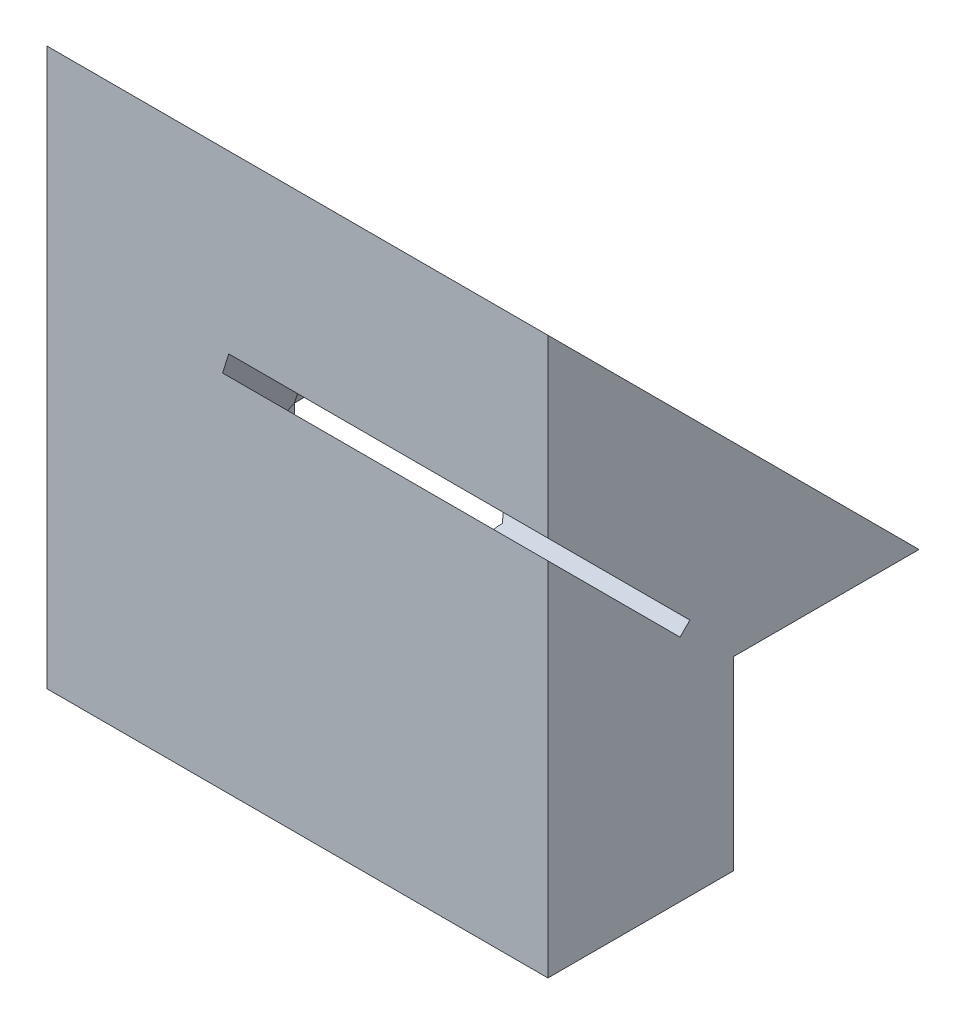
ISO-10303-21;
HEADER;
FILE_DESCRIPTION(('STEP AP214'),'2;1');
FILE_NAME('part.step','',(''),(''),'','','');
FILE_SCHEMA(('AUTOMOTIVE_DESIGN { 1 0 10303 214 1 1 1 1 }'));
ENDSEC;
DATA;
#1=APPLICATION_CONTEXT('core data for automotive mechanical design processes');
#2=APPLICATION_PROTOCOL_DEFINITION('international standard','automotive_design',2000,#1);
#3=PRODUCT_CONTEXT('',#1,'mechanical');
#4=PRODUCT('Part','Part','',(#3));
#5=PRODUCT_RELATED_PRODUCT_CATEGORY('part','',(#4));
#6=PRODUCT_DEFINITION_FORMATION('','',#4);
#7=PRODUCT_DEFINITION_CONTEXT('part definition',#1,'design');
#8=PRODUCT_DEFINITION('design','',#6,#7);
#9=PRODUCT_DEFINITION_SHAPE('','',#8);
#10=(LENGTH_UNIT() NAMED_UNIT(*) SI_UNIT(.MILLI.,.METRE.));
#11=(NAMED_UNIT(*) PLANE_ANGLE_UNIT() SI_UNIT($,.RADIAN.));
#12=(NAMED_UNIT(*) SI_UNIT($,.STERADIAN.) SOLID_ANGLE_UNIT());
#13=UNCERTAINTY_MEASURE_WITH_UNIT(LENGTH_MEASURE(1.E-05),#10,'distance_accuracy_value','');
#14=(GEOMETRIC_REPRESENTATION_CONTEXT(3) GLOBAL_UNCERTAINTY_ASSIGNED_CONTEXT((#13)) GLOBAL_UNIT_ASSIGNED_CONTEXT((#10,
#11,#12)) REPRESENTATION_CONTEXT('',''));
#15=CARTESIAN_POINT('',(0.,0.,0.));
#16=DIRECTION('',(0.,0.,1.));
#17=DIRECTION('',(1.,0.,0.));
#18=AXIS2_PLACEMENT_3D('',#15,#16,#17);
#19=CARTESIAN_POINT('',(0.,0.,0.));
#20=DIRECTION('',(0.,0.,1.));
#21=DIRECTION('',(1.,0.,0.));
#22=AXIS2_PLACEMENT_3D('',#19,#20,#21);
#23=PLANE('',#22);
#24=DIRECTION('',(1.,0.,0.));
#25=VECTOR('',#24,1.);
#26=CARTESIAN_POINT('',(-11.8038475772934,-20.,0.));
#27=LINE('',#26,#25);
#28=CARTESIAN_POINT('',(-9.04783659909774,-20.,0.));
#29=VERTEX_POINT('',#28);
#30=CARTESIAN_POINT('',(2.,-20.,0.));
#31=VERTEX_POINT('',#30);
#32=EDGE_CURVE('E198',#29,#31,#27,.T.);
#33=ORIENTED_EDGE('',*,*,#32,.F.);
#34=DIRECTION('',(0.,-1.,0.));
#35=VECTOR('',#34,1.);
#36=CARTESIAN_POINT('',(-9.04783659909774,0.,0.));
#37=LINE('',#36,#35);
#38=CARTESIAN_POINT('',(-9.04783659909778,-10.,0.));
#39=VERTEX_POINT('',#38);
#40=EDGE_CURVE('E188',#29,#39,#37,.F.);
#41=ORIENTED_EDGE('',*,*,#40,.T.);
#42=DIRECTION('',(-1.,0.,0.));
#43=VECTOR('',#42,1.);
#44=CARTESIAN_POINT('',(25.,-10.,0.));
#45=LINE('',#44,#43);
#46=CARTESIAN_POINT('',(2.,-10.,0.));
#47=VERTEX_POINT('',#46);
#48=EDGE_CURVE('E273',#47,#39,#45,.T.);
#49=ORIENTED_EDGE('',*,*,#48,.F.);
#50=DIRECTION('',(0.,-1.,0.));
#51=VECTOR('',#50,1.);
#52=CARTESIAN_POINT('',(2.,0.,0.));
#53=LINE('',#52,#51);
#54=EDGE_CURVE('E210',#47,#31,#53,.T.);
#55=ORIENTED_EDGE('',*,*,#54,.T.);
#56=EDGE_LOOP('',(#33,#41,#49,#55));
#57=FACE_BOUND('',#56,.T.);
#58=ADVANCED_FACE('F35',(#57),#23,.F.);
#59=DIRECTION('',(-1.,0.,0.));
#60=VECTOR('',#59,1.);
#61=CARTESIAN_POINT('',(-21.6643139440744,-10.,0.));
#62=LINE('',#61,#60);
#63=CARTESIAN_POINT('',(-21.6643139440744,-9.99999999999999,0.));
#64=VERTEX_POINT('',#63);
#65=CARTESIAN_POINT('',(-25.,-10.,0.));
#66=VERTEX_POINT('',#65);
#67=EDGE_CURVE('E275',#64,#66,#62,.T.);
#68=ORIENTED_EDGE('',*,*,#67,.F.);
#69=DIRECTION('',(0.,1.,0.));
#70=VECTOR('',#69,1.);
#71=CARTESIAN_POINT('',(-21.6643139440744,-20.,0.));
#72=LINE('',#71,#70);
#73=CARTESIAN_POINT('',(-21.6643139440744,-20.,0.));
#74=VERTEX_POINT('',#73);
#75=EDGE_CURVE('E246',#74,#64,#72,.T.);
#76=ORIENTED_EDGE('',*,*,#75,.F.);
#77=DIRECTION('',(1.,0.,0.));
#78=VECTOR('',#77,1.);
#79=CARTESIAN_POINT('',(-25.,-20.,0.));
#80=LINE('',#79,#78);
#81=CARTESIAN_POINT('',(-25.,-20.,0.));
#82=VERTEX_POINT('',#81);
#83=EDGE_CURVE('E259',#82,#74,#80,.T.);
#84=ORIENTED_EDGE('',*,*,#83,.F.);
#85=DIRECTION('',(0.,-1.,0.));
#86=VECTOR('',#85,1.);
#87=CARTESIAN_POINT('',(-25.,10.,0.));
#88=LINE('',#87,#86);
#89=EDGE_CURVE('E165',#66,#82,#88,.T.);
#90=ORIENTED_EDGE('',*,*,#89,.F.);
#91=EDGE_LOOP('',(#68,#76,#84,#90));
#92=FACE_BOUND('',#91,.T.);
#93=ADVANCED_FACE('F328',(#92),#23,.F.);
#94=CARTESIAN_POINT('',(0.,0.,10.));
#95=DIRECTION('',(0.,0.,1.));
#96=DIRECTION('',(1.,0.,0.));
#97=AXIS2_PLACEMENT_3D('',#94,#95,#96);
#98=PLANE('',#97);
#99=DIRECTION('',(0.,-1.,0.));
#100=VECTOR('',#99,1.);
#101=CARTESIAN_POINT('',(2.,0.,10.));
#102=LINE('',#101,#100);
#103=CARTESIAN_POINT('',(2.,10.,10.));
#104=VERTEX_POINT('',#103);
#105=CARTESIAN_POINT('',(2.,0.530330085889943,10.));
#106=VERTEX_POINT('',#105);
#107=EDGE_CURVE('E164',#104,#106,#102,.T.);
#108=ORIENTED_EDGE('',*,*,#107,.F.);
#109=DIRECTION('',(-1.,0.,0.));
#110=VECTOR('',#109,1.);
#111=CARTESIAN_POINT('',(-25.,10.,10.));
#112=LINE('',#111,#110);
#113=CARTESIAN_POINT('',(-25.,10.,10.));
#114=VERTEX_POINT('',#113);
#115=EDGE_CURVE('E145',#104,#114,#112,.T.);
#116=ORIENTED_EDGE('',*,*,#115,.T.);
#117=DIRECTION('',(0.,-1.,0.));
#118=VECTOR('',#117,1.);
#119=CARTESIAN_POINT('',(-25.,10.,10.));
#120=LINE('',#119,#118);
#121=CARTESIAN_POINT('',(-25.,-20.,10.));
#122=VERTEX_POINT('',#121);
#123=EDGE_CURVE('E161',#114,#122,#120,.T.);
#124=ORIENTED_EDGE('',*,*,#123,.T.);
#125=DIRECTION('',(-1.,0.,0.));
#126=VECTOR('',#125,1.);
#127=CARTESIAN_POINT('',(25.,-20.,10.));
#128=LINE('',#127,#126);
#129=CARTESIAN_POINT('',(2.,-20.,10.));
#130=VERTEX_POINT('',#129);
#131=EDGE_CURVE('E211',#130,#122,#128,.T.);
#132=ORIENTED_EDGE('',*,*,#131,.F.);
#133=CARTESIAN_POINT('',(2.,-0.530330085889881,10.));
#134=VERTEX_POINT('',#133);
#135=EDGE_CURVE('E280',#134,#130,#102,.T.);
#136=ORIENTED_EDGE('',*,*,#135,.F.);
#137=DIRECTION('',(1.,0.,0.));
#138=VECTOR('',#137,1.);
#139=CARTESIAN_POINT('',(0.,-0.530330085889881,10.));
#140=LINE('',#139,#138);
#141=CARTESIAN_POINT('',(-15.5347902498564,-0.530330085889881,10.));
#142=VERTEX_POINT('',#141);
#143=EDGE_CURVE('E181',#142,#134,#140,.T.);
#144=ORIENTED_EDGE('',*,*,#143,.F.);
#145=DIRECTION('',(-0.300294039609494,-0.953846680434026,0.));
#146=VECTOR('',#145,1.);
#147=CARTESIAN_POINT('',(-13.9820122594664,4.40187613941699,10.));
#148=LINE('',#147,#146);
#149=CARTESIAN_POINT('',(-15.200868735875,0.530330085889944,10.));
#150=VERTEX_POINT('',#149);
#151=EDGE_CURVE('E235',#150,#142,#148,.T.);
#152=ORIENTED_EDGE('',*,*,#151,.F.);
#153=DIRECTION('',(1.,0.,0.));
#154=VECTOR('',#153,1.);
#155=CARTESIAN_POINT('',(0.,0.530330085889941,10.));
#156=LINE('',#155,#154);
#157=EDGE_CURVE('E242',#150,#106,#156,.T.);
#158=ORIENTED_EDGE('',*,*,#157,.T.);
#159=EDGE_LOOP('',(#108,#116,#124,#132,#136,#144,#152,#158));
#160=FACE_BOUND('',#159,.T.);
#161=ADVANCED_FACE('F159',(#160),#98,.T.);
#162=CARTESIAN_POINT('',(-25.,10.,10.));
#163=DIRECTION('',(1.,0.,0.));
#164=DIRECTION('',(0.,1.,0.));
#165=AXIS2_PLACEMENT_3D('',#162,#163,#164);
#166=PLANE('',#165);
#167=ORIENTED_EDGE('',*,*,#123,.F.);
#168=DIRECTION('',(0.,-0.707106781186548,-0.707106781186548));
#169=VECTOR('',#168,1.);
#170=CARTESIAN_POINT('',(-25.,10.,10.));
#171=LINE('',#170,#169);
#172=CARTESIAN_POINT('',(-25.,-10.,-10.));
#173=VERTEX_POINT('',#172);
#174=EDGE_CURVE('E141',#114,#173,#171,.T.);
#175=ORIENTED_EDGE('',*,*,#174,.T.);
#176=DIRECTION('',(0.,0.,1.));
#177=VECTOR('',#176,1.);
#178=CARTESIAN_POINT('',(-25.,-10.,-10.));
#179=LINE('',#178,#177);
#180=EDGE_CURVE('E270',#173,#66,#179,.T.);
#181=ORIENTED_EDGE('',*,*,#180,.T.);
#182=ORIENTED_EDGE('',*,*,#89,.T.);
#183=DIRECTION('',(0.,0.,-1.));
#184=VECTOR('',#183,1.);
#185=CARTESIAN_POINT('',(-25.,-20.,10.));
#186=LINE('',#185,#184);
#187=EDGE_CURVE('E169',#122,#82,#186,.T.);
#188=ORIENTED_EDGE('',*,*,#187,.F.);
#189=EDGE_LOOP('',(#167,#175,#181,#182,#188));
#190=FACE_BOUND('',#189,.T.);
#191=ADVANCED_FACE('F167',(#190),#166,.F.);
#192=CARTESIAN_POINT('',(0.,-5.26516504294494,5.26516504294496));
#193=DIRECTION('',(0.,-0.707106781186546,0.707106781186549));
#194=DIRECTION('',(0.,-0.707106781186549,-0.707106781186546));
#195=AXIS2_PLACEMENT_3D('',#192,#193,#194);
#196=PLANE('',#195);
#197=ORIENTED_EDGE('',*,*,#143,.T.);
#198=DIRECTION('',(0.,-0.707106781186549,-0.707106781186546));
#199=VECTOR('',#198,1.);
#200=CARTESIAN_POINT('',(2.,-5.26516504294494,5.26516504294496));
#201=LINE('',#200,#199);
#202=CARTESIAN_POINT('',(2.,-7.64976811196693,2.88056197392298));
#203=VERTEX_POINT('',#202);
#204=EDGE_CURVE('E226',#134,#203,#201,.T.);
#205=ORIENTED_EDGE('',*,*,#204,.T.);
#206=DIRECTION('',(0.965925826289068,0.18301270189222,0.18301270189222));
#207=VECTOR('',#206,1.);
#208=CARTESIAN_POINT('',(-23.,-12.3864853865046,-1.85615530061468));
#209=LINE('',#208,#207);
#210=CARTESIAN_POINT('',(-10.4043285244551,-10.,0.530330085889914));
#211=VERTEX_POINT('',#210);
#212=EDGE_CURVE('E220',#211,#203,#209,.T.);
#213=ORIENTED_EDGE('',*,*,#212,.F.);
#214=DIRECTION('',(1.,0.,0.));
#215=VECTOR('',#214,1.);
#216=CARTESIAN_POINT('',(-25.,-10.,0.530330085889914));
#217=LINE('',#216,#215);
#218=CARTESIAN_POINT('',(-21.4973531870837,-10.,0.530330085889913));
#219=VERTEX_POINT('',#218);
#220=EDGE_CURVE('E177',#219,#211,#217,.T.);
#221=ORIENTED_EDGE('',*,*,#220,.F.);
#222=DIRECTION('',(-0.406736643075797,-0.645974188021253,-0.645974188021251));
#223=VECTOR('',#222,1.);
#224=CARTESIAN_POINT('',(-23.,-12.3864853865046,-1.85615530061468));
#225=LINE('',#224,#223);
#226=EDGE_CURVE('E228',#142,#219,#225,.T.);
#227=ORIENTED_EDGE('',*,*,#226,.F.);
#228=EDGE_LOOP('',(#197,#205,#213,#221,#227));
#229=FACE_BOUND('',#228,.T.);
#230=ADVANCED_FACE('F224',(#229),#196,.F.);
#231=CARTESIAN_POINT('',(-23.,-11.8561553006147,-2.38648538650459));
#232=DIRECTION('',(-0.913545457642602,0.287606238475949,0.287606238475948));
#233=DIRECTION('',(-0.300294039609494,-0.953846680434026,0.));
#234=AXIS2_PLACEMENT_3D('',#231,#232,#233);
#235=PLANE('',#234);
#236=ORIENTED_EDGE('',*,*,#151,.T.);
#237=ORIENTED_EDGE('',*,*,#226,.T.);
#238=DIRECTION('',(0.300294039609493,0.,0.953846680434027));
#239=VECTOR('',#238,1.);
#240=CARTESIAN_POINT('',(-19.1007697434475,-10.,8.14277942077588));
#241=LINE('',#240,#239);
#242=EDGE_CURVE('E237',#64,#219,#241,.T.);
#243=ORIENTED_EDGE('',*,*,#242,.F.);
#244=DIRECTION('',(-0.300294039609494,-0.953846680434026,0.));
#245=VECTOR('',#244,1.);
#246=CARTESIAN_POINT('',(-16.8463569878228,5.30364124166687,0.));
#247=LINE('',#246,#245);
#248=CARTESIAN_POINT('',(-21.4973531870837,-9.46966991411009,0.));
#249=VERTEX_POINT('',#248);
#250=EDGE_CURVE('E173',#249,#64,#247,.T.);
#251=ORIENTED_EDGE('',*,*,#250,.F.);
#252=DIRECTION('',(-0.406736643075797,-0.645974188021253,-0.645974188021251));
#253=VECTOR('',#252,1.);
#254=CARTESIAN_POINT('',(-23.,-11.8561553006147,-2.38648538650459));
#255=LINE('',#254,#253);
#256=EDGE_CURVE('E227',#150,#249,#255,.T.);
#257=ORIENTED_EDGE('',*,*,#256,.F.);
#258=EDGE_LOOP('',(#236,#237,#243,#251,#257));
#259=FACE_BOUND('',#258,.T.);
#260=ADVANCED_FACE('F321',(#259),#235,.F.);
#261=CARTESIAN_POINT('',(-23.,-11.8561553006147,-2.38648538650459));
#262=DIRECTION('',(0.258819045102522,-0.68301270189222,-0.683012701892218));
#263=DIRECTION('',(0.,0.707106781186546,-0.707106781186549));
#264=AXIS2_PLACEMENT_3D('',#261,#262,#263);
#265=PLANE('',#264);
#266=DIRECTION('',(0.965925826289068,0.18301270189222,0.18301270189222));
#267=VECTOR('',#266,1.);
#268=CARTESIAN_POINT('',(-23.,-11.8561553006147,-2.38648538650459));
#269=LINE('',#268,#267);
#270=CARTESIAN_POINT('',(-10.4043285244551,-9.46966991411009,0.));
#271=VERTEX_POINT('',#270);
#272=CARTESIAN_POINT('',(2.,-7.11943802607702,2.35023188803306));
#273=VERTEX_POINT('',#272);
#274=EDGE_CURVE('E243',#271,#273,#269,.T.);
#275=ORIENTED_EDGE('',*,*,#274,.F.);
#276=CARTESIAN_POINT('',(-9.04783659909778,-8.,-0.955644415261232));
#277=DIRECTION('',(0.258819045102522,-0.68301270189222,-0.683012701892218));
#278=DIRECTION('',(0.242025086471594,-0.638694143126838,0.730406495763758));
#279=AXIS2_PLACEMENT_3D('',#276,#277,#278);
#280=ELLIPSE('',#279,2.92820323027551,2.);
#281=CARTESIAN_POINT('',(-10.1288969001309,-9.68264928773945,0.317350712260575));
#282=VERTEX_POINT('',#281);
#283=EDGE_CURVE('E49',#271,#282,#280,.F.);
#284=ORIENTED_EDGE('',*,*,#283,.T.);
#285=CARTESIAN_POINT('',(-9.04783659909774,-10.9556444152612,2.));
#286=DIRECTION('',(0.258819045102522,-0.68301270189222,-0.683012701892218));
#287=DIRECTION('',(-0.242025086471595,-0.730406495763755,0.63869414312684));
#288=AXIS2_PLACEMENT_3D('',#285,#286,#287);
#289=ELLIPSE('',#288,2.92820323027551,2.);
#290=EDGE_CURVE('E191',#282,#211,#289,.F.);
#291=ORIENTED_EDGE('',*,*,#290,.T.);
#292=ORIENTED_EDGE('',*,*,#212,.T.);
#293=DIRECTION('',(0.,0.707106781186546,-0.707106781186549));
#294=VECTOR('',#293,1.);
#295=CARTESIAN_POINT('',(2.,-7.11943802607702,2.35023188803307));
#296=LINE('',#295,#294);
#297=EDGE_CURVE('E283',#203,#273,#296,.T.);
#298=ORIENTED_EDGE('',*,*,#297,.T.);
#299=EDGE_LOOP('',(#275,#284,#291,#292,#298));
#300=FACE_BOUND('',#299,.T.);
#301=ADVANCED_FACE('F218',(#300),#265,.F.);
#302=CARTESIAN_POINT('',(0.,-4.73483495705503,4.73483495705505));
#303=DIRECTION('',(0.,-0.707106781186546,0.707106781186549));
#304=DIRECTION('',(0.,-0.707106781186549,-0.707106781186546));
#305=AXIS2_PLACEMENT_3D('',#302,#303,#304);
#306=PLANE('',#305);
#307=DIRECTION('',(0.,-0.707106781186549,-0.707106781186546));
#308=VECTOR('',#307,1.);
#309=CARTESIAN_POINT('',(2.,-4.73483495705503,4.73483495705505));
#310=LINE('',#309,#308);
#311=EDGE_CURVE('E285',#106,#273,#310,.T.);
#312=ORIENTED_EDGE('',*,*,#311,.F.);
#313=ORIENTED_EDGE('',*,*,#157,.F.);
#314=ORIENTED_EDGE('',*,*,#256,.T.);
#315=DIRECTION('',(1.,0.,0.));
#316=VECTOR('',#315,1.);
#317=CARTESIAN_POINT('',(0.,-9.46966991411009,0.));
#318=LINE('',#317,#316);
#319=EDGE_CURVE('E170',#249,#271,#318,.T.);
#320=ORIENTED_EDGE('',*,*,#319,.T.);
#321=ORIENTED_EDGE('',*,*,#274,.T.);
#322=EDGE_LOOP('',(#312,#313,#314,#320,#321));
#323=FACE_BOUND('',#322,.T.);
#324=ADVANCED_FACE('F317',(#323),#306,.T.);
#325=CARTESIAN_POINT('',(-21.6643139440744,-20.,0.));
#326=DIRECTION('',(-0.953846680434025,0.,0.300294039609499));
#327=DIRECTION('',(0.300294039609499,0.,0.953846680434025));
#328=AXIS2_PLACEMENT_3D('',#325,#326,#327);
#329=PLANE('',#328);
#330=ORIENTED_EDGE('',*,*,#242,.T.);
#331=DIRECTION('',(0.,1.,0.));
#332=VECTOR('',#331,1.);
#333=CARTESIAN_POINT('',(-21.4973531870837,-20.,0.530330085889913));
#334=LINE('',#333,#332);
#335=CARTESIAN_POINT('',(-21.4973531870837,-20.,0.530330085889913));
#336=VERTEX_POINT('',#335);
#337=EDGE_CURVE('E234',#336,#219,#334,.T.);
#338=ORIENTED_EDGE('',*,*,#337,.F.);
#339=DIRECTION('',(0.300294039609499,0.,0.953846680434025));
#340=VECTOR('',#339,1.);
#341=CARTESIAN_POINT('',(-21.6643139440744,-20.,0.));
#342=LINE('',#341,#340);
#343=EDGE_CURVE('E257',#74,#336,#342,.T.);
#344=ORIENTED_EDGE('',*,*,#343,.F.);
#345=ORIENTED_EDGE('',*,*,#75,.T.);
#346=EDGE_LOOP('',(#330,#338,#344,#345));
#347=FACE_BOUND('',#346,.T.);
#348=ADVANCED_FACE('F325',(#347),#329,.F.);
#349=CARTESIAN_POINT('',(-21.4973531870837,-20.,0.530330085889913));
#350=DIRECTION('',(0.,0.,1.));
#351=DIRECTION('',(1.,0.,0.));
#352=AXIS2_PLACEMENT_3D('',#349,#350,#351);
#353=PLANE('',#352);
#354=ORIENTED_EDGE('',*,*,#220,.T.);
#355=DIRECTION('',(0.,1.,0.));
#356=VECTOR('',#355,1.);
#357=CARTESIAN_POINT('',(-10.4043285244551,-20.,0.530330085889914));
#358=LINE('',#357,#356);
#359=CARTESIAN_POINT('',(-10.4043285244551,-20.,0.530330085889914));
#360=VERTEX_POINT('',#359);
#361=EDGE_CURVE('E214',#360,#211,#358,.T.);
#362=ORIENTED_EDGE('',*,*,#361,.F.);
#363=DIRECTION('',(1.,0.,0.));
#364=VECTOR('',#363,1.);
#365=CARTESIAN_POINT('',(-21.4973531870837,-20.,0.530330085889913));
#366=LINE('',#365,#364);
#367=EDGE_CURVE('E201',#336,#360,#366,.T.);
#368=ORIENTED_EDGE('',*,*,#367,.F.);
#369=ORIENTED_EDGE('',*,*,#337,.T.);
#370=EDGE_LOOP('',(#354,#362,#368,#369));
#371=FACE_BOUND('',#370,.T.);
#372=ADVANCED_FACE('F232',(#371),#353,.F.);
#373=CARTESIAN_POINT('',(0.,-20.,0.));
#374=DIRECTION('',(0.,-1.,0.));
#375=DIRECTION('',(0.,0.,-1.));
#376=AXIS2_PLACEMENT_3D('',#373,#374,#375);
#377=PLANE('',#376);
#378=ORIENTED_EDGE('',*,*,#367,.T.);
#379=CARTESIAN_POINT('',(-9.04783659909774,-20.,2.));
#380=DIRECTION('',(0.,-1.,0.));
#381=DIRECTION('',(0.,0.,-1.));
#382=AXIS2_PLACEMENT_3D('',#379,#380,#381);
#383=CIRCLE('',#382,2.);
#384=EDGE_CURVE('E43',#360,#29,#383,.T.);
#385=ORIENTED_EDGE('',*,*,#384,.T.);
#386=ORIENTED_EDGE('',*,*,#32,.T.);
#387=DIRECTION('',(0.,0.,-1.));
#388=VECTOR('',#387,1.);
#389=CARTESIAN_POINT('',(2.,-20.,16.356125684751));
#390=LINE('',#389,#388);
#391=EDGE_CURVE('E291',#130,#31,#390,.T.);
#392=ORIENTED_EDGE('',*,*,#391,.F.);
#393=ORIENTED_EDGE('',*,*,#131,.T.);
#394=ORIENTED_EDGE('',*,*,#187,.T.);
#395=ORIENTED_EDGE('',*,*,#83,.T.);
#396=ORIENTED_EDGE('',*,*,#343,.T.);
#397=EDGE_LOOP('',(#378,#385,#386,#392,#393,#394,#395,#396));
#398=FACE_BOUND('',#397,.T.);
#399=ADVANCED_FACE('F196',(#398),#377,.T.);
#400=CARTESIAN_POINT('',(-10.4043285244551,-9.46966991411009,-10.));
#401=DIRECTION('',(0.,1.,0.));
#402=DIRECTION('',(0.,0.,1.));
#403=AXIS2_PLACEMENT_3D('',#400,#401,#402);
#404=PLANE('',#403);
#405=DIRECTION('',(0.,0.,1.));
#406=VECTOR('',#405,1.);
#407=CARTESIAN_POINT('',(-21.4973531870837,-9.46966991411009,-10.));
#408=LINE('',#407,#406);
#409=CARTESIAN_POINT('',(-21.4973531870837,-9.46966991411009,-9.4696699141101));
#410=VERTEX_POINT('',#409);
#411=EDGE_CURVE('E265',#410,#249,#408,.T.);
#412=ORIENTED_EDGE('',*,*,#411,.F.);
#413=DIRECTION('',(1.,0.,0.));
#414=VECTOR('',#413,1.);
#415=CARTESIAN_POINT('',(-10.4043285244551,-9.46966991411009,-9.4696699141101));
#416=LINE('',#415,#414);
#417=CARTESIAN_POINT('',(-10.4043285244551,-9.46966991411009,-9.4696699141101));
#418=VERTEX_POINT('',#417);
#419=EDGE_CURVE('E293',#410,#418,#416,.T.);
#420=ORIENTED_EDGE('',*,*,#419,.T.);
#421=DIRECTION('',(0.,0.,1.));
#422=VECTOR('',#421,1.);
#423=CARTESIAN_POINT('',(-10.4043285244551,-9.46966991411009,-10.));
#424=LINE('',#423,#422);
#425=EDGE_CURVE('E262',#418,#271,#424,.T.);
#426=ORIENTED_EDGE('',*,*,#425,.T.);
#427=ORIENTED_EDGE('',*,*,#319,.F.);
#428=EDGE_LOOP('',(#412,#420,#426,#427));
#429=FACE_BOUND('',#428,.T.);
#430=ADVANCED_FACE('F308',(#429),#404,.F.);
#431=CARTESIAN_POINT('',(-21.4973531870837,-9.46966991411009,-10.));
#432=DIRECTION('',(-0.953846680434025,0.300294039609497,0.));
#433=DIRECTION('',(-0.300294039609497,-0.953846680434025,0.));
#434=AXIS2_PLACEMENT_3D('',#431,#432,#433);
#435=PLANE('',#434);
#436=DIRECTION('',(0.,0.,1.));
#437=VECTOR('',#436,1.);
#438=CARTESIAN_POINT('',(-21.6643139440744,-10.,-10.));
#439=LINE('',#438,#437);
#440=CARTESIAN_POINT('',(-21.6643139440744,-10.,-10.));
#441=VERTEX_POINT('',#440);
#442=EDGE_CURVE('E267',#441,#64,#439,.T.);
#443=ORIENTED_EDGE('',*,*,#442,.F.);
#444=DIRECTION('',(0.217295181943267,0.690211128533959,0.690211128533959));
#445=VECTOR('',#444,1.);
#446=CARTESIAN_POINT('',(-21.5768918561775,-9.72231460722457,-9.72231460722458));
#447=LINE('',#446,#445);
#448=EDGE_CURVE('E153',#441,#410,#447,.T.);
#449=ORIENTED_EDGE('',*,*,#448,.T.);
#450=ORIENTED_EDGE('',*,*,#411,.T.);
#451=ORIENTED_EDGE('',*,*,#250,.T.);
#452=EDGE_LOOP('',(#443,#449,#450,#451));
#453=FACE_BOUND('',#452,.T.);
#454=ADVANCED_FACE('F312',(#453),#435,.F.);
#455=CARTESIAN_POINT('',(-21.6643139440744,-10.,-10.));
#456=DIRECTION('',(0.,1.,0.));
#457=DIRECTION('',(0.,0.,1.));
#458=AXIS2_PLACEMENT_3D('',#455,#456,#457);
#459=PLANE('',#458);
#460=ORIENTED_EDGE('',*,*,#67,.T.);
#461=ORIENTED_EDGE('',*,*,#180,.F.);
#462=DIRECTION('',(-1.,0.,0.));
#463=VECTOR('',#462,1.);
#464=CARTESIAN_POINT('',(-21.6643139440744,-10.,-10.));
#465=LINE('',#464,#463);
#466=EDGE_CURVE('E148',#441,#173,#465,.T.);
#467=ORIENTED_EDGE('',*,*,#466,.F.);
#468=ORIENTED_EDGE('',*,*,#442,.T.);
#469=EDGE_LOOP('',(#460,#461,#467,#468));
#470=FACE_BOUND('',#469,.T.);
#471=ADVANCED_FACE('F330',(#470),#459,.F.);
#472=CARTESIAN_POINT('',(25.,-10.,-10.));
#473=DIRECTION('',(0.,1.,0.));
#474=DIRECTION('',(0.,0.,1.));
#475=AXIS2_PLACEMENT_3D('',#472,#473,#474);
#476=PLANE('',#475);
#477=ORIENTED_EDGE('',*,*,#48,.T.);
#478=DIRECTION('',(0.,0.,1.));
#479=VECTOR('',#478,1.);
#480=CARTESIAN_POINT('',(-9.04783659909778,-10.,-10.));
#481=LINE('',#480,#479);
#482=CARTESIAN_POINT('',(-9.04783659909778,-10.,-10.));
#483=VERTEX_POINT('',#482);
#484=EDGE_CURVE('E184',#39,#483,#481,.F.);
#485=ORIENTED_EDGE('',*,*,#484,.T.);
#486=DIRECTION('',(-1.,0.,0.));
#487=VECTOR('',#486,1.);
#488=CARTESIAN_POINT('',(25.,-10.,-10.));
#489=LINE('',#488,#487);
#490=CARTESIAN_POINT('',(2.,-10.,-10.));
#491=VERTEX_POINT('',#490);
#492=EDGE_CURVE('E272',#491,#483,#489,.T.);
#493=ORIENTED_EDGE('',*,*,#492,.F.);
#494=DIRECTION('',(0.,0.,1.));
#495=VECTOR('',#494,1.);
#496=CARTESIAN_POINT('',(2.,-10.,-10.));
#497=LINE('',#496,#495);
#498=EDGE_CURVE('E288',#491,#47,#497,.T.);
#499=ORIENTED_EDGE('',*,*,#498,.T.);
#500=EDGE_LOOP('',(#477,#485,#493,#499));
#501=FACE_BOUND('',#500,.T.);
#502=ADVANCED_FACE('F304',(#501),#476,.F.);
#503=CARTESIAN_POINT('',(2.,10.,16.356125684751));
#504=DIRECTION('',(-1.,0.,0.));
#505=DIRECTION('',(0.,0.,1.));
#506=AXIS2_PLACEMENT_3D('',#503,#504,#505);
#507=PLANE('',#506);
#508=ORIENTED_EDGE('',*,*,#498,.F.);
#509=DIRECTION('',(0.,-0.707106781186548,-0.707106781186548));
#510=VECTOR('',#509,1.);
#511=CARTESIAN_POINT('',(2.,10.,10.));
#512=LINE('',#511,#510);
#513=EDGE_CURVE('E154',#104,#491,#512,.T.);
#514=ORIENTED_EDGE('',*,*,#513,.F.);
#515=ORIENTED_EDGE('',*,*,#107,.T.);
#516=ORIENTED_EDGE('',*,*,#311,.T.);
#517=ORIENTED_EDGE('',*,*,#297,.F.);
#518=ORIENTED_EDGE('',*,*,#204,.F.);
#519=ORIENTED_EDGE('',*,*,#135,.T.);
#520=ORIENTED_EDGE('',*,*,#391,.T.);
#521=ORIENTED_EDGE('',*,*,#54,.F.);
#522=EDGE_LOOP('',(#508,#514,#515,#516,#517,#518,#519,#520,#521));
#523=FACE_BOUND('',#522,.T.);
#524=ADVANCED_FACE('F302',(#523),#507,.F.);
#525=CARTESIAN_POINT('',(-25.,10.,10.));
#526=DIRECTION('',(0.,-0.707106781186548,0.707106781186548));
#527=DIRECTION('',(0.,-0.707106781186548,-0.707106781186548));
#528=AXIS2_PLACEMENT_3D('',#525,#526,#527);
#529=PLANE('',#528);
#530=ORIENTED_EDGE('',*,*,#492,.T.);
#531=CARTESIAN_POINT('',(-9.04783659909778,-8.,-8.));
#532=DIRECTION('',(0.,-0.707106781186548,0.707106781186548));
#533=DIRECTION('',(0.,0.707106781186548,0.707106781186548));
#534=AXIS2_PLACEMENT_3D('',#531,#532,#533);
#535=ELLIPSE('',#534,2.82842712474619,2.);
#536=EDGE_CURVE('E186',#483,#418,#535,.F.);
#537=ORIENTED_EDGE('',*,*,#536,.T.);
#538=ORIENTED_EDGE('',*,*,#419,.F.);
#539=ORIENTED_EDGE('',*,*,#448,.F.);
#540=ORIENTED_EDGE('',*,*,#466,.T.);
#541=ORIENTED_EDGE('',*,*,#174,.F.);
#542=ORIENTED_EDGE('',*,*,#115,.F.);
#543=ORIENTED_EDGE('',*,*,#513,.T.);
#544=EDGE_LOOP('',(#530,#537,#538,#539,#540,#541,#542,#543));
#545=FACE_BOUND('',#544,.T.);
#546=ADVANCED_FACE('F144',(#545),#529,.F.);
#547=CARTESIAN_POINT('',(-9.04783659909778,-8.,-10.));
#548=DIRECTION('',(0.,0.,1.));
#549=DIRECTION('',(1.,0.,0.));
#550=AXIS2_PLACEMENT_3D('',#547,#548,#549);
#551=CYLINDRICAL_SURFACE('',#550,2.);
#552=ORIENTED_EDGE('',*,*,#536,.F.);
#553=ORIENTED_EDGE('',*,*,#484,.F.);
#554=CARTESIAN_POINT('',(-9.04783659909776,-8.,2.));
#555=DIRECTION('',(0.,-0.707106781186547,0.707106781186547));
#556=DIRECTION('',(0.,-0.707106781186547,-0.707106781186547));
#557=AXIS2_PLACEMENT_3D('',#554,#555,#556);
#558=ELLIPSE('',#557,2.82842712474619,2.);
#559=EDGE_CURVE('E11',#39,#282,#558,.F.);
#560=ORIENTED_EDGE('',*,*,#559,.T.);
#561=ORIENTED_EDGE('',*,*,#283,.F.);
#562=ORIENTED_EDGE('',*,*,#425,.F.);
#563=EDGE_LOOP('',(#552,#553,#560,#561,#562));
#564=FACE_BOUND('',#563,.T.);
#565=ADVANCED_FACE('F305',(#564),#551,.T.);
#566=CARTESIAN_POINT('',(-9.04783659909774,-20.,2.));
#567=DIRECTION('',(0.,-1.,0.));
#568=DIRECTION('',(0.,0.,-1.));
#569=AXIS2_PLACEMENT_3D('',#566,#567,#568);
#570=CYLINDRICAL_SURFACE('',#569,2.);
#571=ORIENTED_EDGE('',*,*,#384,.F.);
#572=ORIENTED_EDGE('',*,*,#361,.T.);
#573=ORIENTED_EDGE('',*,*,#290,.F.);
#574=ORIENTED_EDGE('',*,*,#559,.F.);
#575=ORIENTED_EDGE('',*,*,#40,.F.);
#576=EDGE_LOOP('',(#571,#572,#573,#574,#575));
#577=FACE_BOUND('',#576,.T.);
#578=ADVANCED_FACE('F37',(#577),#570,.T.);
#579=CLOSED_SHELL('',(#58,#93,#161,#191,#230,#260,#301,#324,#348,#372,#399,#430,#454,#471,#502,
#524,#546,#565,#578));
#580=MANIFOLD_SOLID_BREP('B2',#579);
#581=ADVANCED_BREP_SHAPE_REPRESENTATION('',(#18,#580),#14);
#582=SHAPE_DEFINITION_REPRESENTATION(#9,#581);
ENDSEC;
END-ISO-10303-21;
